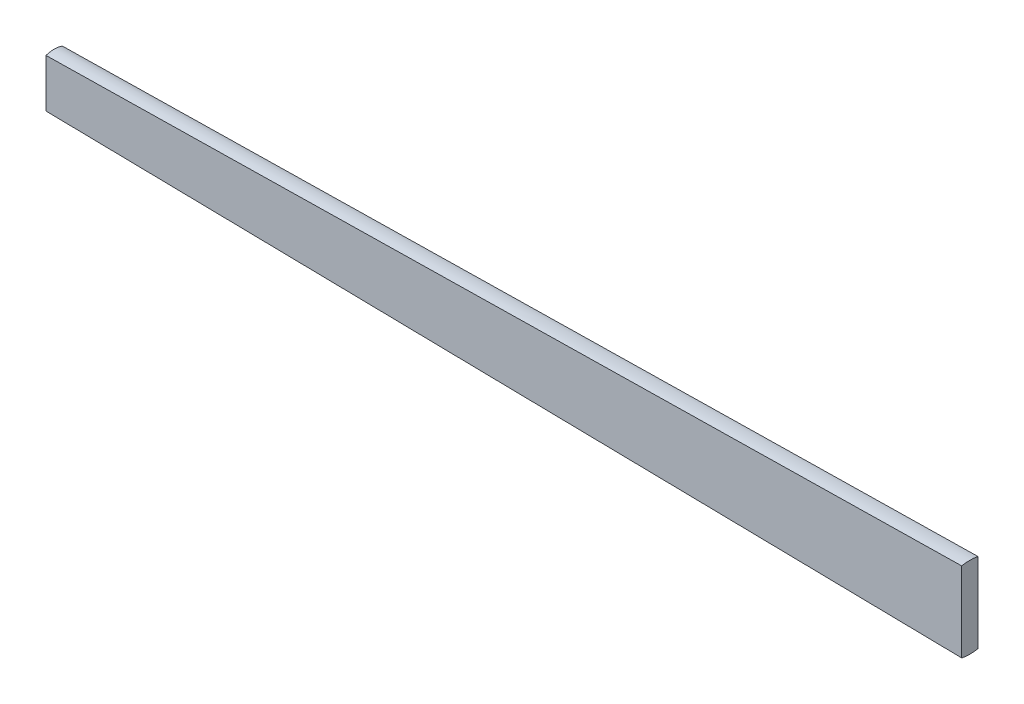
ISO-10303-21;
HEADER;
FILE_DESCRIPTION(('STEP AP214'),'2;1');
FILE_NAME('part.step','',(''),(''),'','','');
FILE_SCHEMA(('AUTOMOTIVE_DESIGN { 1 0 10303 214 1 1 1 1 }'));
ENDSEC;
DATA;
#1=APPLICATION_CONTEXT('core data for automotive mechanical design processes');
#2=APPLICATION_PROTOCOL_DEFINITION('international standard','automotive_design',2000,#1);
#3=PRODUCT_CONTEXT('',#1,'mechanical');
#4=PRODUCT('Part','Part','',(#3));
#5=PRODUCT_RELATED_PRODUCT_CATEGORY('part','',(#4));
#6=PRODUCT_DEFINITION_FORMATION('','',#4);
#7=PRODUCT_DEFINITION_CONTEXT('part definition',#1,'design');
#8=PRODUCT_DEFINITION('design','',#6,#7);
#9=PRODUCT_DEFINITION_SHAPE('','',#8);
#10=(LENGTH_UNIT() NAMED_UNIT(*) SI_UNIT(.MILLI.,.METRE.));
#11=(NAMED_UNIT(*) PLANE_ANGLE_UNIT() SI_UNIT($,.RADIAN.));
#12=(NAMED_UNIT(*) SI_UNIT($,.STERADIAN.) SOLID_ANGLE_UNIT());
#13=UNCERTAINTY_MEASURE_WITH_UNIT(LENGTH_MEASURE(1.E-05),#10,'distance_accuracy_value','');
#14=(GEOMETRIC_REPRESENTATION_CONTEXT(3) GLOBAL_UNCERTAINTY_ASSIGNED_CONTEXT((#13)) GLOBAL_UNIT_ASSIGNED_CONTEXT((#10,
#11,#12)) REPRESENTATION_CONTEXT('',''));
#15=CARTESIAN_POINT('',(0.,0.,0.));
#16=DIRECTION('',(0.,0.,1.));
#17=DIRECTION('',(1.,0.,0.));
#18=AXIS2_PLACEMENT_3D('',#15,#16,#17);
#19=CARTESIAN_POINT('',(-10.5482343550447,3.91918358845308,-0.800000000000001));
#20=DIRECTION('',(0.,0.,1.));
#21=DIRECTION('',(1.,0.,0.));
#22=AXIS2_PLACEMENT_3D('',#19,#20,#21);
#23=PLANE('',#22);
#24=CARTESIAN_POINT('',(169.802654152405,-5.44724962761256,-0.800000000000001));
#25=CARTESIAN_POINT('',(167.997764500478,-5.41684547755674,-0.800000000000001));
#26=CARTESIAN_POINT('',(166.192874939661,-5.38643592186902,-0.800000000000001));
#27=CARTESIAN_POINT('',(162.583096294069,-5.32560550752142,-0.800000000000001));
#28=CARTESIAN_POINT('',(160.778207209296,-5.29518464886333,-0.800000000000001));
#29=CARTESIAN_POINT('',(151.75376321505,-5.1430508605447,-0.800000000000001));
#30=CARTESIAN_POINT('',(144.534209797251,-5.02124939866899,-0.800000000000001));
#31=CARTESIAN_POINT('',(130.095103949054,-4.77740951257392,-0.800000000000001));
#32=CARTESIAN_POINT('',(122.875551518657,-4.65537108825562,-0.800000000000001));
#33=CARTESIAN_POINT('',(101.216879670114,-4.28882141087684,-0.800000000000001));
#34=CARTESIAN_POINT('',(86.7777675848953,-4.04387612210668,-0.800000000000001));
#35=CARTESIAN_POINT('',(65.1191249234133,-3.67497194319809,-0.800000000000001));
#36=CARTESIAN_POINT('',(57.8995816931947,-3.5517561772965,-0.800000000000001));
#37=CARTESIAN_POINT('',(43.4605070179115,-3.30464077589007,-0.800000000000001));
#38=CARTESIAN_POINT('',(36.2409755728467,-3.18074114039345,-0.800000000000001));
#39=CARTESIAN_POINT('',(21.8019519210736,-2.93198503307049,-0.800000000000001));
#40=CARTESIAN_POINT('',(14.5824597143133,-2.80712856426295,-0.800000000000001));
#41=CARTESIAN_POINT('',(0.143499590421727,-2.55599839125601,-0.800000000000001));
#42=CARTESIAN_POINT('',(-7.07596832670826,-2.42972468698904,-0.800000000000001));
#43=CARTESIAN_POINT('',(-21.5148682485795,-2.17497837393414,-0.800000000000001));
#44=CARTESIAN_POINT('',(-28.7343002533064,-2.04650576432444,-0.800000000000001));
#45=CARTESIAN_POINT('',(-39.5633959869929,-1.85091078380635,-0.800000000000001));
#46=CARTESIAN_POINT('',(-43.1730857386037,-1.78523144807052,-0.800000000000001));
#47=CARTESIAN_POINT('',(-50.3924402936104,-1.65251769616798,-0.800000000000001));
#48=CARTESIAN_POINT('',(-54.0021050970069,-1.58548328002805,-0.800000000000001));
#49=CARTESIAN_POINT('',(-61.2175551977948,-1.44954488610605,-0.800000000000001));
#50=CARTESIAN_POINT('',(-64.8233405338764,-1.38064297481127,-0.800000000000001));
#51=CARTESIAN_POINT('',(-70.231971735992,-1.27501779847345,-0.800000000000001));
#52=CARTESIAN_POINT('',(-72.034839768994,-1.23943071326505,-0.800000000000001));
#53=CARTESIAN_POINT('',(-75.6405566023374,-1.16726895773638,-0.800000000000001));
#54=CARTESIAN_POINT('',(-77.4434054026736,-1.13069428715802,-0.800000000000001));
#55=CARTESIAN_POINT('',(-81.0490832623606,-1.05623345178498,-0.800000000000001));
#56=CARTESIAN_POINT('',(-82.8519123216022,-1.01834728169418,-0.800000000000001));
#57=CARTESIAN_POINT('',(-86.4575305549902,-0.94076462951557,-0.800000000000001));
#58=CARTESIAN_POINT('',(-88.2603197291637,-0.901068148702283,-0.800000000000001));
#59=CARTESIAN_POINT('',(-90.96446164929,-0.839511283167597,-0.800000000000001));
#60=CARTESIAN_POINT('',(-91.8658372633469,-0.818656923370206,-0.800000000000001));
#61=CARTESIAN_POINT('',(-93.6685681392483,-0.77609583921996,-0.800000000000001));
#62=CARTESIAN_POINT('',(-94.5699234010986,-0.754389115118031,-0.800000000000001));
#63=CARTESIAN_POINT('',(-96.3726095854956,-0.709893153792861,-0.800000000000001));
#64=CARTESIAN_POINT('',(-97.273940507979,-0.687103913987415,-0.800000000000001));
#65=CARTESIAN_POINT('',(-99.076563936478,-0.64002395411852,-0.800000000000001));
#66=CARTESIAN_POINT('',(-99.9778564424535,-0.615733232532151,-0.800000000000001));
#67=CARTESIAN_POINT('',(-100.879122862494,-0.590482285010542,-0.800000000000001));
#68=B_SPLINE_CURVE_WITH_KNOTS('',3,(#24,#25,#26,#27,#28,#29,#30,#31,#32,#33,#34,#35,#36,#37,#38,
#39,#40,#41,#42,#43,#44,#45,#46,#47,#48,#49,#50,#51,#52,#53,#54,#55,#56,#57,#58,#59,#60,#61,#62,
#63,#64,#65,#66,#67),.UNSPECIFIED.,.F.,.F.,(4,2,2,2,2,2,2,2,2,2,2,2,2,2,2,2,2,2,2,2,2,4),(0.,
5.41543715784623,10.8308734591039,32.4926158665375,54.1543673206769,97.4779359091111,
119.139719727952,140.801503286278,162.463218529884,184.124934806104,205.786659177732,
216.617520679123,227.448381966451,238.267711766421,243.677369260661,249.087028168656,
254.496708924575,259.906385871966,262.611236034306,265.316085400373,268.020941218836,
270.725799780817),.UNSPECIFIED.);
#69=CARTESIAN_POINT('',(79.4617656449553,-3.91918358845308,-0.800000000000001));
#70=VERTEX_POINT('',#69);
#71=CARTESIAN_POINT('',(-10.5382343550447,-2.3685438564654,-0.800000000000001));
#72=VERTEX_POINT('',#71);
#73=EDGE_CURVE('E77',#70,#72,#68,.T.);
#74=ORIENTED_EDGE('',*,*,#73,.T.);
#75=DIRECTION('',(0.,1.,0.));
#76=VECTOR('',#75,1.);
#77=CARTESIAN_POINT('',(-10.5382343550447,0.,-0.800000000000001));
#78=LINE('',#77,#76);
#79=CARTESIAN_POINT('',(-10.5382343550447,2.3685438564654,-0.800000000000001));
#80=VERTEX_POINT('',#79);
#81=EDGE_CURVE('E86',#72,#80,#78,.T.);
#82=ORIENTED_EDGE('',*,*,#81,.T.);
#83=CARTESIAN_POINT('',(-100.879122862494,0.590482285010526,-0.800000000000001));
#84=CARTESIAN_POINT('',(-100.227364669657,0.608746998306762,-0.800000000000001));
#85=CARTESIAN_POINT('',(-99.5755927177272,0.626508856322431,-0.800000000000001));
#86=CARTESIAN_POINT('',(-97.620240922537,0.678521465226013,-0.800000000000001));
#87=CARTESIAN_POINT('',(-96.3166271312098,0.711499192810879,-0.800000000000001));
#88=CARTESIAN_POINT('',(-93.7093467620063,0.775316215926257,-0.800000000000001));
#89=CARTESIAN_POINT('',(-92.4056801840766,0.80615550924472,-0.800000000000001));
#90=CARTESIAN_POINT('',(-89.7983114792503,0.866298183944611,-0.800000000000001));
#91=CARTESIAN_POINT('',(-88.4946093523489,0.895601565122426,-0.800000000000001));
#92=CARTESIAN_POINT('',(-85.8871799833331,0.953071304379715,-0.800000000000001));
#93=CARTESIAN_POINT('',(-84.583452741215,0.981237662295003,-0.800000000000001));
#94=CARTESIAN_POINT('',(-80.6722421636712,1.06443674741119,-0.800000000000001));
#95=CARTESIAN_POINT('',(-78.0647312097457,1.11816945812101,-0.800000000000001));
#96=CARTESIAN_POINT('',(-72.8496618191049,1.22343089681467,-0.800000000000001));
#97=CARTESIAN_POINT('',(-70.2421033823319,1.27495962191501,-0.800000000000001));
#98=CARTESIAN_POINT('',(-65.026957407501,1.37647567272848,-0.800000000000001));
#99=CARTESIAN_POINT('',(-62.4193698694527,1.42646299894144,-0.800000000000001));
#100=CARTESIAN_POINT('',(-54.5965938541775,1.57477629480587,-0.800000000000001));
#101=CARTESIAN_POINT('',(-49.3813741989565,1.67145393370607,-0.800000000000001));
#102=CARTESIAN_POINT('',(-38.9508882783537,1.86226717453204,-0.800000000000001));
#103=CARTESIAN_POINT('',(-33.7356220129679,1.95640277624461,-0.800000000000001));
#104=CARTESIAN_POINT('',(-23.3050581470108,2.14301783441899,-0.800000000000001));
#105=CARTESIAN_POINT('',(-18.0897605464296,2.23549729033033,-0.800000000000001));
#106=CARTESIAN_POINT('',(-7.65914555394068,2.41932008399031,-0.800000000000001));
#107=CARTESIAN_POINT('',(-2.44382816203373,2.51066342178054,-0.800000000000001));
#108=CARTESIAN_POINT('',(13.2021364390234,2.78349012580678,-0.800000000000001));
#109=CARTESIAN_POINT('',(23.6328046137038,2.96377033424582,-0.800000000000001));
#110=CARTESIAN_POINT('',(44.4941702098429,3.32253136200187,-0.800000000000001));
#111=CARTESIAN_POINT('',(54.9248676312969,3.50101218159559,-0.800000000000001));
#112=CARTESIAN_POINT('',(74.0594783891942,3.82737410516927,-0.800000000000001));
#113=CARTESIAN_POINT('',(82.763388755434,3.9754294033098,-0.800000000000001));
#114=CARTESIAN_POINT('',(100.171219582036,4.27096990850672,-0.800000000000001));
#115=CARTESIAN_POINT('',(108.875140042399,4.41845511553557,-0.800000000000001));
#116=CARTESIAN_POINT('',(126.282989940543,4.71300650507412,-0.800000000000001));
#117=CARTESIAN_POINT('',(134.986919378326,4.86007268749288,-0.800000000000001));
#118=CARTESIAN_POINT('',(152.394783284826,5.15388072097697,-0.800000000000001));
#119=CARTESIAN_POINT('',(161.098717753542,5.30062257205882,-0.800000000000001));
#120=CARTESIAN_POINT('',(169.802654152405,5.44724962761259,-0.800000000000001));
#121=B_SPLINE_CURVE_WITH_KNOTS('',3,(#83,#84,#85,#86,#87,#88,#89,#90,#91,#92,#93,#94,#95,#96,
#97,#98,#99,#100,#101,#102,#103,#104,#105,#106,#107,#108,#109,#110,#111,#112,#113,#114,#115,
#116,#117,#118,#119,#120),.UNSPECIFIED.,.F.,.F.,(4,2,2,2,2,2,2,2,2,2,2,2,2,2,2,2,2,2,4),(0.,
1.95604147907774,5.8681304137694,9.78022339516353,13.6923168951733,17.6044109600859,
25.428602788921,33.2528048538926,41.0770043816599,56.7253500961697,72.3736971232134,
88.0220493514235,103.670401006877,134.967078693169,166.263751566245,192.379260040203,
218.494769775498,244.6102851778,270.725799249238),.UNSPECIFIED.);
#122=CARTESIAN_POINT('',(79.4617656449553,3.91918358845309,-0.800000000000001));
#123=VERTEX_POINT('',#122);
#124=EDGE_CURVE('E79',#80,#123,#121,.T.);
#125=ORIENTED_EDGE('',*,*,#124,.T.);
#126=DIRECTION('',(0.,-1.,0.));
#127=VECTOR('',#126,1.);
#128=CARTESIAN_POINT('',(79.4617656449553,4.00000000000001,-0.800000000000001));
#129=LINE('',#128,#127);
#130=EDGE_CURVE('E38',#123,#70,#129,.T.);
#131=ORIENTED_EDGE('',*,*,#130,.T.);
#132=EDGE_LOOP('',(#74,#82,#125,#131));
#133=FACE_BOUND('',#132,.T.);
#134=ADVANCED_FACE('F33',(#133),#23,.F.);
#135=CARTESIAN_POINT('',(-10.5482343550447,3.91918358845308,0.799999999999999));
#136=DIRECTION('',(0.,0.,1.));
#137=DIRECTION('',(1.,0.,0.));
#138=AXIS2_PLACEMENT_3D('',#135,#136,#137);
#139=PLANE('',#138);
#140=CARTESIAN_POINT('',(169.802654152405,-5.44724962761256,0.799999999999999));
#141=CARTESIAN_POINT('',(167.997764500478,-5.41684547755674,0.799999999999999));
#142=CARTESIAN_POINT('',(166.192874939661,-5.38643592186902,0.799999999999999));
#143=CARTESIAN_POINT('',(162.583096294069,-5.32560550752142,0.799999999999999));
#144=CARTESIAN_POINT('',(160.778207209296,-5.29518464886333,0.799999999999999));
#145=CARTESIAN_POINT('',(151.75376321505,-5.1430508605447,0.799999999999999));
#146=CARTESIAN_POINT('',(144.534209797251,-5.02124939866899,0.799999999999999));
#147=CARTESIAN_POINT('',(130.095103949054,-4.77740951257392,0.799999999999999));
#148=CARTESIAN_POINT('',(122.875551518657,-4.65537108825562,0.799999999999999));
#149=CARTESIAN_POINT('',(101.216879670114,-4.28882141087684,0.799999999999999));
#150=CARTESIAN_POINT('',(86.7777675848953,-4.04387612210668,0.799999999999999));
#151=CARTESIAN_POINT('',(65.1191249234133,-3.67497194319809,0.799999999999999));
#152=CARTESIAN_POINT('',(57.8995816931947,-3.5517561772965,0.799999999999999));
#153=CARTESIAN_POINT('',(43.4605070179115,-3.30464077589007,0.799999999999999));
#154=CARTESIAN_POINT('',(36.2409755728467,-3.18074114039345,0.799999999999999));
#155=CARTESIAN_POINT('',(21.8019519210736,-2.93198503307049,0.799999999999999));
#156=CARTESIAN_POINT('',(14.5824597143133,-2.80712856426295,0.799999999999999));
#157=CARTESIAN_POINT('',(0.143499590421727,-2.55599839125601,0.799999999999999));
#158=CARTESIAN_POINT('',(-7.07596832670826,-2.42972468698904,0.799999999999999));
#159=CARTESIAN_POINT('',(-21.5148682485795,-2.17497837393414,0.799999999999999));
#160=CARTESIAN_POINT('',(-28.7343002533064,-2.04650576432444,0.799999999999999));
#161=CARTESIAN_POINT('',(-39.5633959869929,-1.85091078380635,0.799999999999999));
#162=CARTESIAN_POINT('',(-43.1730857386037,-1.78523144807052,0.799999999999999));
#163=CARTESIAN_POINT('',(-50.3924402936104,-1.65251769616798,0.799999999999999));
#164=CARTESIAN_POINT('',(-54.0021050970069,-1.58548328002805,0.799999999999999));
#165=CARTESIAN_POINT('',(-61.2175551977948,-1.44954488610605,0.799999999999999));
#166=CARTESIAN_POINT('',(-64.8233405338764,-1.38064297481127,0.799999999999999));
#167=CARTESIAN_POINT('',(-70.231971735992,-1.27501779847345,0.799999999999999));
#168=CARTESIAN_POINT('',(-72.034839768994,-1.23943071326505,0.799999999999999));
#169=CARTESIAN_POINT('',(-75.6405566023374,-1.16726895773638,0.799999999999999));
#170=CARTESIAN_POINT('',(-77.4434054026736,-1.13069428715802,0.799999999999999));
#171=CARTESIAN_POINT('',(-81.0490832623606,-1.05623345178498,0.799999999999999));
#172=CARTESIAN_POINT('',(-82.8519123216022,-1.01834728169418,0.799999999999999));
#173=CARTESIAN_POINT('',(-86.4575305549902,-0.940764629515571,0.799999999999999));
#174=CARTESIAN_POINT('',(-88.2603197291637,-0.901068148702285,0.799999999999999));
#175=CARTESIAN_POINT('',(-90.96446164929,-0.8395112831676,0.799999999999999));
#176=CARTESIAN_POINT('',(-91.8658372633469,-0.818656923370208,0.799999999999999));
#177=CARTESIAN_POINT('',(-93.6685681392483,-0.776095839219962,0.799999999999999));
#178=CARTESIAN_POINT('',(-94.5699234010986,-0.754389115118033,0.799999999999999));
#179=CARTESIAN_POINT('',(-96.3726095854956,-0.709893153792863,0.799999999999999));
#180=CARTESIAN_POINT('',(-97.273940507979,-0.687103913987418,0.799999999999999));
#181=CARTESIAN_POINT('',(-99.076563936478,-0.640023954118523,0.799999999999999));
#182=CARTESIAN_POINT('',(-99.9778564424535,-0.615733232532154,0.799999999999999));
#183=CARTESIAN_POINT('',(-100.879122862494,-0.590482285010544,0.799999999999999));
#184=B_SPLINE_CURVE_WITH_KNOTS('',3,(#140,#141,#142,#143,#144,#145,#146,#147,#148,#149,#150,
#151,#152,#153,#154,#155,#156,#157,#158,#159,#160,#161,#162,#163,#164,#165,#166,#167,#168,#169,
#170,#171,#172,#173,#174,#175,#176,#177,#178,#179,#180,#181,#182,#183),.UNSPECIFIED.,.F.,.F.,(4,
2,2,2,2,2,2,2,2,2,2,2,2,2,2,2,2,2,2,2,2,4),(0.,5.41543715784623,10.8308734591039,
32.4926158665375,54.1543673206769,97.4779359091111,119.139719727952,140.801503286278,
162.463218529884,184.124934806104,205.786659177732,216.617520679123,227.448381966451,
238.267711766421,243.677369260661,249.087028168656,254.496708924575,259.906385871966,
262.611236034306,265.316085400373,268.020941218836,270.725799780817),.UNSPECIFIED.);
#185=CARTESIAN_POINT('',(79.4617656449553,-3.91918358845308,0.799999999999999));
#186=VERTEX_POINT('',#185);
#187=CARTESIAN_POINT('',(-10.5382343550447,-2.3685438564654,0.799999999999999));
#188=VERTEX_POINT('',#187);
#189=EDGE_CURVE('E121',#186,#188,#184,.T.);
#190=ORIENTED_EDGE('',*,*,#189,.F.);
#191=DIRECTION('',(0.,-1.,0.));
#192=VECTOR('',#191,1.);
#193=CARTESIAN_POINT('',(79.4617656449553,4.00000000000001,0.799999999999999));
#194=LINE('',#193,#192);
#195=CARTESIAN_POINT('',(79.4617656449553,3.91918358845309,0.799999999999999));
#196=VERTEX_POINT('',#195);
#197=EDGE_CURVE('E51',#196,#186,#194,.T.);
#198=ORIENTED_EDGE('',*,*,#197,.F.);
#199=CARTESIAN_POINT('',(-100.879122862494,0.590482285010528,0.799999999999999));
#200=CARTESIAN_POINT('',(-100.227364669657,0.608746998306764,0.799999999999999));
#201=CARTESIAN_POINT('',(-99.5755927177272,0.626508856322433,0.799999999999999));
#202=CARTESIAN_POINT('',(-97.620240922537,0.678521465226015,0.799999999999999));
#203=CARTESIAN_POINT('',(-96.3166271312098,0.711499192810881,0.799999999999999));
#204=CARTESIAN_POINT('',(-93.7093467620063,0.775316215926259,0.799999999999999));
#205=CARTESIAN_POINT('',(-92.4056801840766,0.806155509244722,0.799999999999999));
#206=CARTESIAN_POINT('',(-89.7983114792503,0.866298183944613,0.799999999999999));
#207=CARTESIAN_POINT('',(-88.4946093523489,0.895601565122428,0.799999999999999));
#208=CARTESIAN_POINT('',(-85.8871799833331,0.953071304379717,0.799999999999999));
#209=CARTESIAN_POINT('',(-84.583452741215,0.981237662295004,0.799999999999999));
#210=CARTESIAN_POINT('',(-80.6722421636712,1.06443674741119,0.799999999999999));
#211=CARTESIAN_POINT('',(-78.0647312097457,1.11816945812102,0.799999999999999));
#212=CARTESIAN_POINT('',(-72.8496618191049,1.22343089681467,0.799999999999999));
#213=CARTESIAN_POINT('',(-70.2421033823319,1.27495962191501,0.799999999999999));
#214=CARTESIAN_POINT('',(-65.026957407501,1.37647567272848,0.799999999999999));
#215=CARTESIAN_POINT('',(-62.4193698694527,1.42646299894144,0.799999999999999));
#216=CARTESIAN_POINT('',(-54.5965938541775,1.57477629480587,0.799999999999999));
#217=CARTESIAN_POINT('',(-49.3813741989565,1.67145393370607,0.799999999999999));
#218=CARTESIAN_POINT('',(-38.9508882783537,1.86226717453205,0.799999999999999));
#219=CARTESIAN_POINT('',(-33.7356220129679,1.95640277624461,0.799999999999999));
#220=CARTESIAN_POINT('',(-23.3050581470108,2.14301783441899,0.799999999999999));
#221=CARTESIAN_POINT('',(-18.0897605464296,2.23549729033033,0.799999999999999));
#222=CARTESIAN_POINT('',(-7.65914555394068,2.41932008399031,0.799999999999999));
#223=CARTESIAN_POINT('',(-2.44382816203373,2.51066342178054,0.799999999999999));
#224=CARTESIAN_POINT('',(13.2021364390234,2.78349012580678,0.799999999999999));
#225=CARTESIAN_POINT('',(23.6328046137038,2.96377033424583,0.799999999999999));
#226=CARTESIAN_POINT('',(44.4941702098429,3.32253136200187,0.799999999999999));
#227=CARTESIAN_POINT('',(54.9248676312969,3.50101218159559,0.799999999999999));
#228=CARTESIAN_POINT('',(74.0594783891942,3.82737410516927,0.799999999999999));
#229=CARTESIAN_POINT('',(82.763388755434,3.9754294033098,0.799999999999999));
#230=CARTESIAN_POINT('',(100.171219582036,4.27096990850672,0.799999999999999));
#231=CARTESIAN_POINT('',(108.875140042399,4.41845511553557,0.799999999999999));
#232=CARTESIAN_POINT('',(126.282989940543,4.71300650507412,0.799999999999999));
#233=CARTESIAN_POINT('',(134.986919378326,4.86007268749288,0.799999999999999));
#234=CARTESIAN_POINT('',(152.394783284826,5.15388072097697,0.799999999999999));
#235=CARTESIAN_POINT('',(161.098717753542,5.30062257205882,0.799999999999999));
#236=CARTESIAN_POINT('',(169.802654152405,5.44724962761259,0.799999999999999));
#237=B_SPLINE_CURVE_WITH_KNOTS('',3,(#199,#200,#201,#202,#203,#204,#205,#206,#207,#208,#209,
#210,#211,#212,#213,#214,#215,#216,#217,#218,#219,#220,#221,#222,#223,#224,#225,#226,#227,#228,
#229,#230,#231,#232,#233,#234,#235,#236),.UNSPECIFIED.,.F.,.F.,(4,2,2,2,2,2,2,2,2,2,2,2,2,2,2,2,
2,2,4),(0.,1.95604147907774,5.8681304137694,9.78022339516353,13.6923168951733,17.6044109600859,
25.428602788921,33.2528048538926,41.0770043816599,56.7253500961697,72.3736971232134,
88.0220493514235,103.670401006877,134.967078693169,166.263751566245,192.379260040203,
218.494769775498,244.6102851778,270.725799249238),.UNSPECIFIED.);
#238=CARTESIAN_POINT('',(-10.5382343550447,2.3685438564654,0.799999999999999));
#239=VERTEX_POINT('',#238);
#240=EDGE_CURVE('E114',#239,#196,#237,.T.);
#241=ORIENTED_EDGE('',*,*,#240,.F.);
#242=DIRECTION('',(0.,1.,0.));
#243=VECTOR('',#242,1.);
#244=CARTESIAN_POINT('',(-10.5382343550447,0.,0.799999999999999));
#245=LINE('',#244,#243);
#246=EDGE_CURVE('E94',#188,#239,#245,.T.);
#247=ORIENTED_EDGE('',*,*,#246,.F.);
#248=EDGE_LOOP('',(#190,#198,#241,#247));
#249=FACE_BOUND('',#248,.T.);
#250=ADVANCED_FACE('F107',(#249),#139,.T.);
#251=CARTESIAN_POINT('',(79.4617656449553,4.00000000000001,0.));
#252=DIRECTION('',(1.,0.,0.));
#253=DIRECTION('',(0.,1.,0.));
#254=AXIS2_PLACEMENT_3D('',#251,#252,#253);
#255=PLANE('',#254);
#256=ORIENTED_EDGE('',*,*,#130,.F.);
#257=CARTESIAN_POINT('',(79.4617656449553,0.,0.));
#258=DIRECTION('',(1.,0.,0.));
#259=DIRECTION('',(0.,1.,0.));
#260=AXIS2_PLACEMENT_3D('',#257,#258,#259);
#261=CIRCLE('',#260,4.);
#262=EDGE_CURVE('E12',#123,#196,#261,.T.);
#263=ORIENTED_EDGE('',*,*,#262,.T.);
#264=ORIENTED_EDGE('',*,*,#197,.T.);
#265=EDGE_CURVE('E43',#186,#70,#261,.T.);
#266=ORIENTED_EDGE('',*,*,#265,.T.);
#267=EDGE_LOOP('',(#256,#263,#264,#266));
#268=FACE_BOUND('',#267,.T.);
#269=ADVANCED_FACE('F88',(#268),#255,.T.);
#270=CARTESIAN_POINT('',(-10.5382343550447,0.,0.));
#271=DIRECTION('',(-1.,0.,0.));
#272=DIRECTION('',(0.,-1.,0.));
#273=AXIS2_PLACEMENT_3D('',#270,#271,#272);
#274=PLANE('',#273);
#275=ORIENTED_EDGE('',*,*,#81,.F.);
#276=CARTESIAN_POINT('',(-10.5382343550447,0.,0.));
#277=DIRECTION('',(1.,0.,0.));
#278=DIRECTION('',(0.,1.,0.));
#279=AXIS2_PLACEMENT_3D('',#276,#277,#278);
#280=CIRCLE('',#279,2.5);
#281=EDGE_CURVE('E85',#188,#72,#280,.T.);
#282=ORIENTED_EDGE('',*,*,#281,.F.);
#283=ORIENTED_EDGE('',*,*,#246,.T.);
#284=EDGE_CURVE('E89',#80,#239,#280,.T.);
#285=ORIENTED_EDGE('',*,*,#284,.F.);
#286=EDGE_LOOP('',(#275,#282,#283,#285));
#287=FACE_BOUND('',#286,.T.);
#288=ADVANCED_FACE('F130',(#287),#274,.T.);
#289=CARTESIAN_POINT('',(79.4617656449553,0.,0.));
#290=DIRECTION('',(1.,0.,0.));
#291=DIRECTION('',(0.,1.,0.));
#292=AXIS2_PLACEMENT_3D('',#289,#290,#291);
#293=CONICAL_SURFACE('',#292,4.,0.0166651237139408);
#294=ORIENTED_EDGE('',*,*,#124,.F.);
#295=ORIENTED_EDGE('',*,*,#284,.T.);
#296=ORIENTED_EDGE('',*,*,#240,.T.);
#297=ORIENTED_EDGE('',*,*,#262,.F.);
#298=EDGE_LOOP('',(#294,#295,#296,#297));
#299=FACE_BOUND('',#298,.T.);
#300=ADVANCED_FACE('F35',(#299),#293,.T.);
#301=ORIENTED_EDGE('',*,*,#73,.F.);
#302=ORIENTED_EDGE('',*,*,#265,.F.);
#303=ORIENTED_EDGE('',*,*,#189,.T.);
#304=ORIENTED_EDGE('',*,*,#281,.T.);
#305=EDGE_LOOP('',(#301,#302,#303,#304));
#306=FACE_BOUND('',#305,.T.);
#307=ADVANCED_FACE('F83',(#306),#293,.T.);
#308=CLOSED_SHELL('',(#134,#250,#269,#288,#300,#307));
#309=MANIFOLD_SOLID_BREP('B2',#308);
#310=ADVANCED_BREP_SHAPE_REPRESENTATION('',(#18,#309),#14);
#311=SHAPE_DEFINITION_REPRESENTATION(#9,#310);
ENDSEC;
END-ISO-10303-21;
